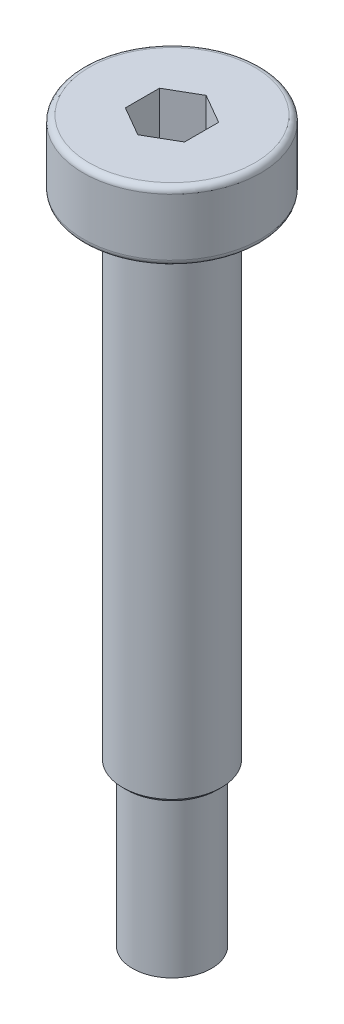
ISO-10303-21;
HEADER;
FILE_DESCRIPTION(('STEP AP214'),'2;1');
FILE_NAME('part.step','',(''),(''),'','','');
FILE_SCHEMA(('AUTOMOTIVE_DESIGN { 1 0 10303 214 1 1 1 1 }'));
ENDSEC;
DATA;
#1=APPLICATION_CONTEXT('core data for automotive mechanical design processes');
#2=APPLICATION_PROTOCOL_DEFINITION('international standard','automotive_design',2000,#1);
#3=PRODUCT_CONTEXT('',#1,'mechanical');
#4=PRODUCT('Part','Part','',(#3));
#5=PRODUCT_RELATED_PRODUCT_CATEGORY('part','',(#4));
#6=PRODUCT_DEFINITION_FORMATION('','',#4);
#7=PRODUCT_DEFINITION_CONTEXT('part definition',#1,'design');
#8=PRODUCT_DEFINITION('design','',#6,#7);
#9=PRODUCT_DEFINITION_SHAPE('','',#8);
#10=(LENGTH_UNIT() NAMED_UNIT(*) SI_UNIT(.MILLI.,.METRE.));
#11=(NAMED_UNIT(*) PLANE_ANGLE_UNIT() SI_UNIT($,.RADIAN.));
#12=(NAMED_UNIT(*) SI_UNIT($,.STERADIAN.) SOLID_ANGLE_UNIT());
#13=UNCERTAINTY_MEASURE_WITH_UNIT(LENGTH_MEASURE(1.E-05),#10,'distance_accuracy_value','');
#14=(GEOMETRIC_REPRESENTATION_CONTEXT(3) GLOBAL_UNCERTAINTY_ASSIGNED_CONTEXT((#13)) GLOBAL_UNIT_ASSIGNED_CONTEXT((#10,
#11,#12)) REPRESENTATION_CONTEXT('',''));
#15=CARTESIAN_POINT('',(0.,0.,0.));
#16=DIRECTION('',(0.,0.,1.));
#17=DIRECTION('',(1.,0.,0.));
#18=AXIS2_PLACEMENT_3D('',#15,#16,#17);
#19=CARTESIAN_POINT('',(0.,3.5,0.));
#20=DIRECTION('',(0.,1.,0.));
#21=DIRECTION('',(-1.,0.,0.));
#22=AXIS2_PLACEMENT_3D('',#19,#20,#21);
#23=PLANE('',#22);
#24=DIRECTION('',(0.,0.,-1.));
#25=VECTOR('',#24,1.);
#26=CARTESIAN_POINT('',(1.5,3.5,0.866025403784437));
#27=LINE('',#26,#25);
#28=CARTESIAN_POINT('',(1.5,3.5,0.866025403784437));
#29=VERTEX_POINT('',#28);
#30=CARTESIAN_POINT('',(1.5,3.5,-0.866025403784439));
#31=VERTEX_POINT('',#30);
#32=EDGE_CURVE('E62',#29,#31,#27,.T.);
#33=ORIENTED_EDGE('',*,*,#32,.F.);
#34=DIRECTION('',(0.866025403784439,0.,-0.5));
#35=VECTOR('',#34,1.);
#36=CARTESIAN_POINT('',(0.,3.5,1.73205080756888));
#37=LINE('',#36,#35);
#38=CARTESIAN_POINT('',(0.,3.5,1.73205080756888));
#39=VERTEX_POINT('',#38);
#40=EDGE_CURVE('E155',#39,#29,#37,.T.);
#41=ORIENTED_EDGE('',*,*,#40,.F.);
#42=DIRECTION('',(0.866025403784439,0.,0.5));
#43=VECTOR('',#42,1.);
#44=CARTESIAN_POINT('',(-1.5,3.5,0.866025403784438));
#45=LINE('',#44,#43);
#46=CARTESIAN_POINT('',(-1.5,3.5,0.866025403784438));
#47=VERTEX_POINT('',#46);
#48=EDGE_CURVE('E152',#47,#39,#45,.T.);
#49=ORIENTED_EDGE('',*,*,#48,.F.);
#50=DIRECTION('',(0.,0.,1.));
#51=VECTOR('',#50,1.);
#52=CARTESIAN_POINT('',(-1.5,3.5,-0.866025403784438));
#53=LINE('',#52,#51);
#54=CARTESIAN_POINT('',(-1.5,3.5,-0.866025403784438));
#55=VERTEX_POINT('',#54);
#56=EDGE_CURVE('E110',#55,#47,#53,.T.);
#57=ORIENTED_EDGE('',*,*,#56,.F.);
#58=DIRECTION('',(-0.866025403784439,0.,0.5));
#59=VECTOR('',#58,1.);
#60=CARTESIAN_POINT('',(0.,3.5,-1.73205080756888));
#61=LINE('',#60,#59);
#62=CARTESIAN_POINT('',(0.,3.5,-1.73205080756888));
#63=VERTEX_POINT('',#62);
#64=EDGE_CURVE('E146',#63,#55,#61,.T.);
#65=ORIENTED_EDGE('',*,*,#64,.F.);
#66=DIRECTION('',(-0.866025403784439,0.,-0.5));
#67=VECTOR('',#66,1.);
#68=CARTESIAN_POINT('',(1.5,3.5,-0.866025403784439));
#69=LINE('',#68,#67);
#70=EDGE_CURVE('E142',#31,#63,#69,.T.);
#71=ORIENTED_EDGE('',*,*,#70,.F.);
#72=EDGE_LOOP('',(#33,#41,#49,#57,#65,#71));
#73=FACE_BOUND('',#72,.T.);
#74=CARTESIAN_POINT('',(0.,3.5,0.));
#75=DIRECTION('',(0.,1.,0.));
#76=DIRECTION('',(-1.,0.,0.));
#77=AXIS2_PLACEMENT_3D('',#74,#75,#76);
#78=CIRCLE('',#77,4.2);
#79=CARTESIAN_POINT('',(-4.2,3.5,0.));
#80=VERTEX_POINT('',#79);
#81=EDGE_CURVE('E194',#80,#80,#78,.T.);
#82=ORIENTED_EDGE('',*,*,#81,.T.);
#83=EDGE_LOOP('',(#82));
#84=FACE_BOUND('',#83,.T.);
#85=ADVANCED_FACE('F45',(#73,#84),#23,.T.);
#86=CARTESIAN_POINT('',(0.,3.5,0.));
#87=DIRECTION('',(0.,1.,0.));
#88=DIRECTION('',(-1.,0.,0.));
#89=AXIS2_PLACEMENT_3D('',#86,#87,#88);
#90=CYLINDRICAL_SURFACE('',#89,4.5);
#91=CARTESIAN_POINT('',(0.,0.3,0.));
#92=DIRECTION('',(0.,-1.,0.));
#93=DIRECTION('',(1.,0.,0.));
#94=AXIS2_PLACEMENT_3D('',#91,#92,#93);
#95=CIRCLE('',#94,4.5);
#96=CARTESIAN_POINT('',(4.5,0.300000000000001,0.));
#97=VERTEX_POINT('',#96);
#98=EDGE_CURVE('E186',#97,#97,#95,.F.);
#99=ORIENTED_EDGE('',*,*,#98,.T.);
#100=EDGE_LOOP('',(#99));
#101=FACE_BOUND('',#100,.T.);
#102=CARTESIAN_POINT('',(0.,3.2,0.));
#103=DIRECTION('',(0.,1.,0.));
#104=DIRECTION('',(-1.,0.,0.));
#105=AXIS2_PLACEMENT_3D('',#102,#103,#104);
#106=CIRCLE('',#105,4.5);
#107=CARTESIAN_POINT('',(-4.5,3.2,0.));
#108=VERTEX_POINT('',#107);
#109=EDGE_CURVE('E182',#108,#108,#106,.F.);
#110=ORIENTED_EDGE('',*,*,#109,.T.);
#111=EDGE_LOOP('',(#110));
#112=FACE_BOUND('',#111,.T.);
#113=ADVANCED_FACE('F213',(#101,#112),#90,.T.);
#114=CARTESIAN_POINT('',(-4.5,0.,0.));
#115=DIRECTION('',(0.,-1.,0.));
#116=DIRECTION('',(1.,0.,0.));
#117=AXIS2_PLACEMENT_3D('',#114,#115,#116);
#118=PLANE('',#117);
#119=CARTESIAN_POINT('',(0.,0.,0.));
#120=DIRECTION('',(0.,-1.,0.));
#121=DIRECTION('',(1.,0.,0.));
#122=AXIS2_PLACEMENT_3D('',#119,#120,#121);
#123=CIRCLE('',#122,4.2);
#124=CARTESIAN_POINT('',(4.2,0.,0.));
#125=VERTEX_POINT('',#124);
#126=EDGE_CURVE('E190',#125,#125,#123,.T.);
#127=ORIENTED_EDGE('',*,*,#126,.T.);
#128=EDGE_LOOP('',(#127));
#129=FACE_BOUND('',#128,.T.);
#130=CARTESIAN_POINT('',(0.,0.,0.));
#131=DIRECTION('',(0.,1.,0.));
#132=DIRECTION('',(-1.,0.,0.));
#133=AXIS2_PLACEMENT_3D('',#130,#131,#132);
#134=CIRCLE('',#133,2.49999999999994);
#135=CARTESIAN_POINT('',(-2.49999999999994,0.,0.));
#136=VERTEX_POINT('',#135);
#137=EDGE_CURVE('E178',#136,#136,#134,.T.);
#138=ORIENTED_EDGE('',*,*,#137,.T.);
#139=EDGE_LOOP('',(#138));
#140=FACE_BOUND('',#139,.T.);
#141=ADVANCED_FACE('F219',(#129,#140),#118,.T.);
#142=CARTESIAN_POINT('',(0.,3.5,0.));
#143=DIRECTION('',(0.,1.,0.));
#144=DIRECTION('',(-1.,0.,0.));
#145=AXIS2_PLACEMENT_3D('',#142,#143,#144);
#146=CYLINDRICAL_SURFACE('',#145,2.49999999999997);
#147=CARTESIAN_POINT('',(0.,-24.8,0.));
#148=DIRECTION('',(0.,-1.,0.));
#149=DIRECTION('',(1.,0.,0.));
#150=AXIS2_PLACEMENT_3D('',#147,#148,#149);
#151=CIRCLE('',#150,2.49999999999997);
#152=CARTESIAN_POINT('',(2.49999999999997,-24.8,0.));
#153=VERTEX_POINT('',#152);
#154=EDGE_CURVE('E55',#153,#153,#151,.F.);
#155=ORIENTED_EDGE('',*,*,#154,.T.);
#156=EDGE_LOOP('',(#155));
#157=FACE_BOUND('',#156,.T.);
#158=ORIENTED_EDGE('',*,*,#137,.F.);
#159=EDGE_LOOP('',(#158));
#160=FACE_BOUND('',#159,.T.);
#161=ADVANCED_FACE('F201',(#157,#160),#146,.T.);
#162=CARTESIAN_POINT('',(-2.5,-25.,0.));
#163=DIRECTION('',(0.,-1.,0.));
#164=DIRECTION('',(1.,0.,0.));
#165=AXIS2_PLACEMENT_3D('',#162,#163,#164);
#166=PLANE('',#165);
#167=CARTESIAN_POINT('',(0.,-25.,0.));
#168=DIRECTION('',(0.,-1.,0.));
#169=DIRECTION('',(1.,0.,0.));
#170=AXIS2_PLACEMENT_3D('',#167,#168,#169);
#171=CIRCLE('',#170,2.3);
#172=CARTESIAN_POINT('',(2.3,-25.,0.));
#173=VERTEX_POINT('',#172);
#174=EDGE_CURVE('E11',#173,#173,#171,.T.);
#175=ORIENTED_EDGE('',*,*,#174,.T.);
#176=EDGE_LOOP('',(#175));
#177=FACE_BOUND('',#176,.T.);
#178=CARTESIAN_POINT('',(0.,-25.,0.));
#179=DIRECTION('',(0.,1.,0.));
#180=DIRECTION('',(-1.,0.,0.));
#181=AXIS2_PLACEMENT_3D('',#178,#179,#180);
#182=CIRCLE('',#181,2.);
#183=CARTESIAN_POINT('',(-2.,-25.,0.));
#184=VERTEX_POINT('',#183);
#185=EDGE_CURVE('E174',#184,#184,#182,.T.);
#186=ORIENTED_EDGE('',*,*,#185,.T.);
#187=EDGE_LOOP('',(#186));
#188=FACE_BOUND('',#187,.T.);
#189=ADVANCED_FACE('F255',(#177,#188),#166,.T.);
#190=CARTESIAN_POINT('',(0.,3.5,0.));
#191=DIRECTION('',(0.,1.,0.));
#192=DIRECTION('',(-1.,0.,0.));
#193=AXIS2_PLACEMENT_3D('',#190,#191,#192);
#194=CYLINDRICAL_SURFACE('',#193,2.);
#195=CARTESIAN_POINT('',(0.,-33.,0.));
#196=DIRECTION('',(0.,1.,0.));
#197=DIRECTION('',(-1.,0.,0.));
#198=AXIS2_PLACEMENT_3D('',#195,#196,#197);
#199=CIRCLE('',#198,2.);
#200=CARTESIAN_POINT('',(-2.,-33.,0.));
#201=VERTEX_POINT('',#200);
#202=EDGE_CURVE('E161',#201,#201,#199,.T.);
#203=ORIENTED_EDGE('',*,*,#202,.T.);
#204=EDGE_LOOP('',(#203));
#205=FACE_BOUND('',#204,.T.);
#206=ORIENTED_EDGE('',*,*,#185,.F.);
#207=EDGE_LOOP('',(#206));
#208=FACE_BOUND('',#207,.T.);
#209=ADVANCED_FACE('F251',(#205,#208),#194,.T.);
#210=CARTESIAN_POINT('',(-2.,-33.,0.));
#211=DIRECTION('',(0.,-1.,0.));
#212=DIRECTION('',(1.,0.,0.));
#213=AXIS2_PLACEMENT_3D('',#210,#211,#212);
#214=PLANE('',#213);
#215=ORIENTED_EDGE('',*,*,#202,.F.);
#216=EDGE_LOOP('',(#215));
#217=FACE_BOUND('',#216,.T.);
#218=ADVANCED_FACE('F228',(#217),#214,.T.);
#219=CARTESIAN_POINT('',(0.,0.3,0.));
#220=DIRECTION('',(0.,-1.,0.));
#221=DIRECTION('',(1.,0.,0.));
#222=AXIS2_PLACEMENT_3D('',#219,#220,#221);
#223=TOROIDAL_SURFACE('',#222,4.2,0.3);
#224=ORIENTED_EDGE('',*,*,#126,.F.);
#225=EDGE_LOOP('',(#224));
#226=FACE_BOUND('',#225,.T.);
#227=ORIENTED_EDGE('',*,*,#98,.F.);
#228=EDGE_LOOP('',(#227));
#229=FACE_BOUND('',#228,.T.);
#230=ADVANCED_FACE('F225',(#226,#229),#223,.T.);
#231=CARTESIAN_POINT('',(0.,3.2,0.));
#232=DIRECTION('',(0.,1.,0.));
#233=DIRECTION('',(-1.,0.,0.));
#234=AXIS2_PLACEMENT_3D('',#231,#232,#233);
#235=TOROIDAL_SURFACE('',#234,4.2,0.3);
#236=ORIENTED_EDGE('',*,*,#109,.F.);
#237=EDGE_LOOP('',(#236));
#238=FACE_BOUND('',#237,.T.);
#239=ORIENTED_EDGE('',*,*,#81,.F.);
#240=EDGE_LOOP('',(#239));
#241=FACE_BOUND('',#240,.T.);
#242=ADVANCED_FACE('F227',(#238,#241),#235,.T.);
#243=CARTESIAN_POINT('',(1.5,1.1,0.866025403784437));
#244=DIRECTION('',(1.,0.,0.));
#245=DIRECTION('',(0.,1.,0.));
#246=AXIS2_PLACEMENT_3D('',#243,#244,#245);
#247=PLANE('',#246);
#248=ORIENTED_EDGE('',*,*,#32,.T.);
#249=DIRECTION('',(0.,1.,0.));
#250=VECTOR('',#249,1.);
#251=CARTESIAN_POINT('',(1.5,1.1,-0.866025403784439));
#252=LINE('',#251,#250);
#253=CARTESIAN_POINT('',(1.5,1.1,-0.866025403784439));
#254=VERTEX_POINT('',#253);
#255=EDGE_CURVE('E92',#254,#31,#252,.T.);
#256=ORIENTED_EDGE('',*,*,#255,.F.);
#257=DIRECTION('',(0.,0.,-1.));
#258=VECTOR('',#257,1.);
#259=CARTESIAN_POINT('',(1.5,1.1,0.866025403784437));
#260=LINE('',#259,#258);
#261=CARTESIAN_POINT('',(1.5,1.1,0.866025403784437));
#262=VERTEX_POINT('',#261);
#263=EDGE_CURVE('E158',#262,#254,#260,.T.);
#264=ORIENTED_EDGE('',*,*,#263,.F.);
#265=DIRECTION('',(0.,1.,0.));
#266=VECTOR('',#265,1.);
#267=CARTESIAN_POINT('',(1.5,1.1,0.866025403784437));
#268=LINE('',#267,#266);
#269=EDGE_CURVE('E70',#262,#29,#268,.T.);
#270=ORIENTED_EDGE('',*,*,#269,.T.);
#271=EDGE_LOOP('',(#248,#256,#264,#270));
#272=FACE_BOUND('',#271,.T.);
#273=ADVANCED_FACE('F231',(#272),#247,.F.);
#274=CARTESIAN_POINT('',(0.,1.1,1.73205080756888));
#275=DIRECTION('',(0.5,0.,0.866025403784439));
#276=DIRECTION('',(0.866025403784439,0.,-0.5));
#277=AXIS2_PLACEMENT_3D('',#274,#275,#276);
#278=PLANE('',#277);
#279=ORIENTED_EDGE('',*,*,#40,.T.);
#280=ORIENTED_EDGE('',*,*,#269,.F.);
#281=DIRECTION('',(0.866025403784439,0.,-0.5));
#282=VECTOR('',#281,1.);
#283=CARTESIAN_POINT('',(0.,1.1,1.73205080756888));
#284=LINE('',#283,#282);
#285=CARTESIAN_POINT('',(0.,1.1,1.73205080756888));
#286=VERTEX_POINT('',#285);
#287=EDGE_CURVE('E124',#286,#262,#284,.T.);
#288=ORIENTED_EDGE('',*,*,#287,.F.);
#289=DIRECTION('',(0.,1.,0.));
#290=VECTOR('',#289,1.);
#291=CARTESIAN_POINT('',(0.,1.1,1.73205080756888));
#292=LINE('',#291,#290);
#293=EDGE_CURVE('E115',#286,#39,#292,.T.);
#294=ORIENTED_EDGE('',*,*,#293,.T.);
#295=EDGE_LOOP('',(#279,#280,#288,#294));
#296=FACE_BOUND('',#295,.T.);
#297=ADVANCED_FACE('F236',(#296),#278,.F.);
#298=CARTESIAN_POINT('',(-1.5,1.1,0.866025403784438));
#299=DIRECTION('',(-0.5,0.,0.866025403784438));
#300=DIRECTION('',(0.866025403784439,0.,0.5));
#301=AXIS2_PLACEMENT_3D('',#298,#299,#300);
#302=PLANE('',#301);
#303=ORIENTED_EDGE('',*,*,#48,.T.);
#304=ORIENTED_EDGE('',*,*,#293,.F.);
#305=DIRECTION('',(0.866025403784439,0.,0.5));
#306=VECTOR('',#305,1.);
#307=CARTESIAN_POINT('',(-1.5,1.1,0.866025403784438));
#308=LINE('',#307,#306);
#309=CARTESIAN_POINT('',(-1.5,1.1,0.866025403784438));
#310=VERTEX_POINT('',#309);
#311=EDGE_CURVE('E119',#310,#286,#308,.T.);
#312=ORIENTED_EDGE('',*,*,#311,.F.);
#313=DIRECTION('',(0.,1.,0.));
#314=VECTOR('',#313,1.);
#315=CARTESIAN_POINT('',(-1.5,1.1,0.866025403784438));
#316=LINE('',#315,#314);
#317=EDGE_CURVE('E103',#310,#47,#316,.T.);
#318=ORIENTED_EDGE('',*,*,#317,.T.);
#319=EDGE_LOOP('',(#303,#304,#312,#318));
#320=FACE_BOUND('',#319,.T.);
#321=ADVANCED_FACE('F120',(#320),#302,.F.);
#322=CARTESIAN_POINT('',(-1.5,1.1,-0.866025403784438));
#323=DIRECTION('',(-1.,0.,0.));
#324=DIRECTION('',(0.,0.,1.));
#325=AXIS2_PLACEMENT_3D('',#322,#323,#324);
#326=PLANE('',#325);
#327=ORIENTED_EDGE('',*,*,#56,.T.);
#328=ORIENTED_EDGE('',*,*,#317,.F.);
#329=DIRECTION('',(0.,0.,1.));
#330=VECTOR('',#329,1.);
#331=CARTESIAN_POINT('',(-1.5,1.1,-0.866025403784438));
#332=LINE('',#331,#330);
#333=CARTESIAN_POINT('',(-1.5,1.1,-0.866025403784438));
#334=VERTEX_POINT('',#333);
#335=EDGE_CURVE('E107',#334,#310,#332,.T.);
#336=ORIENTED_EDGE('',*,*,#335,.F.);
#337=DIRECTION('',(0.,1.,0.));
#338=VECTOR('',#337,1.);
#339=CARTESIAN_POINT('',(-1.5,1.1,-0.866025403784438));
#340=LINE('',#339,#338);
#341=EDGE_CURVE('E116',#334,#55,#340,.T.);
#342=ORIENTED_EDGE('',*,*,#341,.T.);
#343=EDGE_LOOP('',(#327,#328,#336,#342));
#344=FACE_BOUND('',#343,.T.);
#345=ADVANCED_FACE('F105',(#344),#326,.F.);
#346=CARTESIAN_POINT('',(0.,1.1,-1.73205080756888));
#347=DIRECTION('',(-0.5,0.,-0.866025403784439));
#348=DIRECTION('',(-0.866025403784439,0.,0.5));
#349=AXIS2_PLACEMENT_3D('',#346,#347,#348);
#350=PLANE('',#349);
#351=ORIENTED_EDGE('',*,*,#64,.T.);
#352=ORIENTED_EDGE('',*,*,#341,.F.);
#353=DIRECTION('',(-0.866025403784439,0.,0.5));
#354=VECTOR('',#353,1.);
#355=CARTESIAN_POINT('',(0.,1.1,-1.73205080756888));
#356=LINE('',#355,#354);
#357=CARTESIAN_POINT('',(0.,1.1,-1.73205080756888));
#358=VERTEX_POINT('',#357);
#359=EDGE_CURVE('E130',#358,#334,#356,.T.);
#360=ORIENTED_EDGE('',*,*,#359,.F.);
#361=DIRECTION('',(0.,1.,0.));
#362=VECTOR('',#361,1.);
#363=CARTESIAN_POINT('',(0.,1.1,-1.73205080756888));
#364=LINE('',#363,#362);
#365=EDGE_CURVE('E166',#358,#63,#364,.T.);
#366=ORIENTED_EDGE('',*,*,#365,.T.);
#367=EDGE_LOOP('',(#351,#352,#360,#366));
#368=FACE_BOUND('',#367,.T.);
#369=ADVANCED_FACE('F331',(#368),#350,.F.);
#370=CARTESIAN_POINT('',(1.5,1.1,-0.866025403784439));
#371=DIRECTION('',(0.5,0.,-0.866025403784439));
#372=DIRECTION('',(-0.866025403784439,0.,-0.5));
#373=AXIS2_PLACEMENT_3D('',#370,#371,#372);
#374=PLANE('',#373);
#375=ORIENTED_EDGE('',*,*,#70,.T.);
#376=ORIENTED_EDGE('',*,*,#365,.F.);
#377=DIRECTION('',(-0.866025403784439,0.,-0.5));
#378=VECTOR('',#377,1.);
#379=CARTESIAN_POINT('',(1.5,1.1,-0.866025403784439));
#380=LINE('',#379,#378);
#381=EDGE_CURVE('E134',#254,#358,#380,.T.);
#382=ORIENTED_EDGE('',*,*,#381,.F.);
#383=ORIENTED_EDGE('',*,*,#255,.T.);
#384=EDGE_LOOP('',(#375,#376,#382,#383));
#385=FACE_BOUND('',#384,.T.);
#386=ADVANCED_FACE('F209',(#385),#374,.F.);
#387=CARTESIAN_POINT('',(0.,1.1,0.));
#388=DIRECTION('',(0.,1.,0.));
#389=DIRECTION('',(0.,0.,1.));
#390=AXIS2_PLACEMENT_3D('',#387,#388,#389);
#391=PLANE('',#390);
#392=ORIENTED_EDGE('',*,*,#263,.T.);
#393=ORIENTED_EDGE('',*,*,#381,.T.);
#394=ORIENTED_EDGE('',*,*,#359,.T.);
#395=ORIENTED_EDGE('',*,*,#335,.T.);
#396=ORIENTED_EDGE('',*,*,#311,.T.);
#397=ORIENTED_EDGE('',*,*,#287,.T.);
#398=EDGE_LOOP('',(#392,#393,#394,#395,#396,#397));
#399=FACE_BOUND('',#398,.T.);
#400=ADVANCED_FACE('F127',(#399),#391,.T.);
#401=CARTESIAN_POINT('',(0.,-24.8,0.));
#402=DIRECTION('',(0.,1.,0.));
#403=DIRECTION('',(-1.,0.,0.));
#404=AXIS2_PLACEMENT_3D('',#401,#402,#403);
#405=CONICAL_SURFACE('',#404,2.49999999999997,0.785398163397444);
#406=ORIENTED_EDGE('',*,*,#174,.F.);
#407=EDGE_LOOP('',(#406));
#408=FACE_BOUND('',#407,.T.);
#409=ORIENTED_EDGE('',*,*,#154,.F.);
#410=EDGE_LOOP('',(#409));
#411=FACE_BOUND('',#410,.T.);
#412=ADVANCED_FACE('F48',(#408,#411),#405,.T.);
#413=CLOSED_SHELL('',(#85,#113,#141,#161,#189,#209,#218,#230,#242,#273,#297,#321,#345,#369,#386,
#400,#412));
#414=MANIFOLD_SOLID_BREP('B2',#413);
#415=ADVANCED_BREP_SHAPE_REPRESENTATION('',(#18,#414),#14);
#416=SHAPE_DEFINITION_REPRESENTATION(#9,#415);
ENDSEC;
END-ISO-10303-21;
